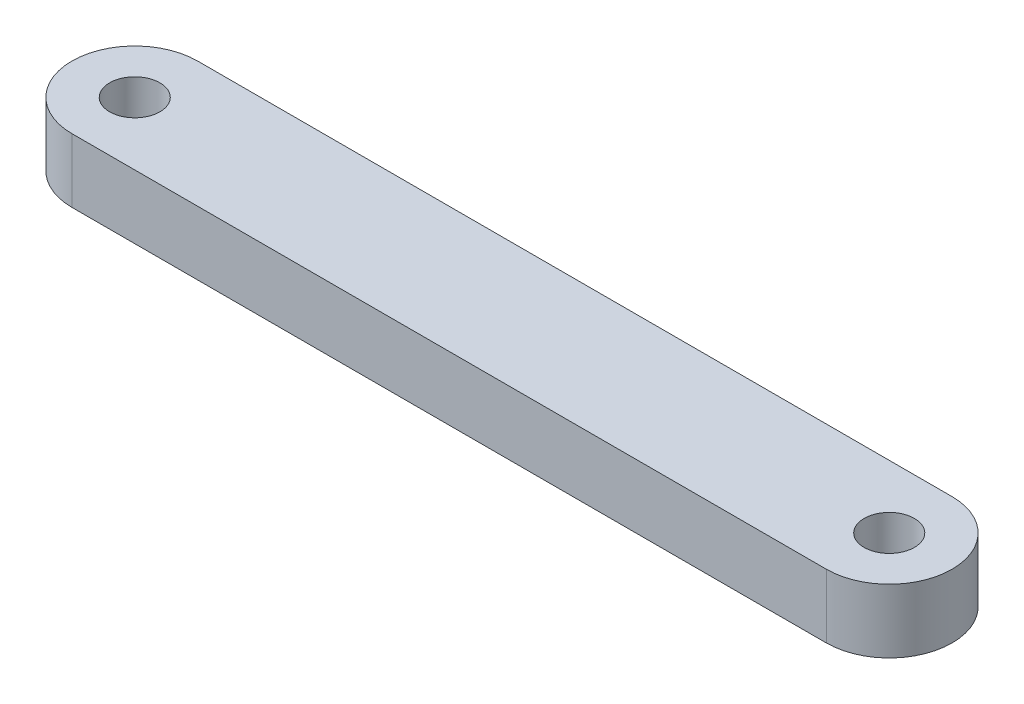
ISO-10303-21;
HEADER;
FILE_DESCRIPTION(('STEP AP214'),'2;1');
FILE_NAME('part.step','',(''),(''),'','','');
FILE_SCHEMA(('AUTOMOTIVE_DESIGN { 1 0 10303 214 1 1 1 1 }'));
ENDSEC;
DATA;
#1=APPLICATION_CONTEXT('core data for automotive mechanical design processes');
#2=APPLICATION_PROTOCOL_DEFINITION('international standard','automotive_design',2000,#1);
#3=PRODUCT_CONTEXT('',#1,'mechanical');
#4=PRODUCT('Part','Part','',(#3));
#5=PRODUCT_RELATED_PRODUCT_CATEGORY('part','',(#4));
#6=PRODUCT_DEFINITION_FORMATION('','',#4);
#7=PRODUCT_DEFINITION_CONTEXT('part definition',#1,'design');
#8=PRODUCT_DEFINITION('design','',#6,#7);
#9=PRODUCT_DEFINITION_SHAPE('','',#8);
#10=(LENGTH_UNIT() NAMED_UNIT(*) SI_UNIT(.MILLI.,.METRE.));
#11=(NAMED_UNIT(*) PLANE_ANGLE_UNIT() SI_UNIT($,.RADIAN.));
#12=(NAMED_UNIT(*) SI_UNIT($,.STERADIAN.) SOLID_ANGLE_UNIT());
#13=UNCERTAINTY_MEASURE_WITH_UNIT(LENGTH_MEASURE(1.E-05),#10,'distance_accuracy_value','');
#14=(GEOMETRIC_REPRESENTATION_CONTEXT(3) GLOBAL_UNCERTAINTY_ASSIGNED_CONTEXT((#13)) GLOBAL_UNIT_ASSIGNED_CONTEXT((#10,
#11,#12)) REPRESENTATION_CONTEXT('',''));
#15=CARTESIAN_POINT('',(0.,0.,0.));
#16=DIRECTION('',(0.,0.,1.));
#17=DIRECTION('',(1.,0.,0.));
#18=AXIS2_PLACEMENT_3D('',#15,#16,#17);
#19=CARTESIAN_POINT('',(15.,2.54,0.));
#20=DIRECTION('',(0.,-1.,0.));
#21=DIRECTION('',(0.,0.,-1.));
#22=AXIS2_PLACEMENT_3D('',#19,#20,#21);
#23=CYLINDRICAL_SURFACE('',#22,2.5);
#24=CARTESIAN_POINT('',(15.,0.,0.));
#25=DIRECTION('',(0.,1.,0.));
#26=DIRECTION('',(0.,0.,-1.));
#27=AXIS2_PLACEMENT_3D('',#24,#25,#26);
#28=CIRCLE('',#27,2.5);
#29=CARTESIAN_POINT('',(15.,0.,2.5));
#30=VERTEX_POINT('',#29);
#31=CARTESIAN_POINT('',(15.,0.,-2.5));
#32=VERTEX_POINT('',#31);
#33=EDGE_CURVE('E113',#30,#32,#28,.T.);
#34=ORIENTED_EDGE('',*,*,#33,.T.);
#35=DIRECTION('',(0.,-1.,0.));
#36=VECTOR('',#35,1.);
#37=CARTESIAN_POINT('',(15.,2.54,-2.5));
#38=LINE('',#37,#36);
#39=CARTESIAN_POINT('',(15.,2.54,-2.5));
#40=VERTEX_POINT('',#39);
#41=EDGE_CURVE('E11',#40,#32,#38,.T.);
#42=ORIENTED_EDGE('',*,*,#41,.F.);
#43=CARTESIAN_POINT('',(15.,2.54,0.));
#44=DIRECTION('',(0.,1.,0.));
#45=DIRECTION('',(0.,0.,-1.));
#46=AXIS2_PLACEMENT_3D('',#43,#44,#45);
#47=CIRCLE('',#46,2.5);
#48=CARTESIAN_POINT('',(15.,2.54,2.5));
#49=VERTEX_POINT('',#48);
#50=EDGE_CURVE('E100',#49,#40,#47,.T.);
#51=ORIENTED_EDGE('',*,*,#50,.F.);
#52=DIRECTION('',(0.,-1.,0.));
#53=VECTOR('',#52,1.);
#54=CARTESIAN_POINT('',(15.,2.54,2.5));
#55=LINE('',#54,#53);
#56=EDGE_CURVE('E109',#49,#30,#55,.T.);
#57=ORIENTED_EDGE('',*,*,#56,.T.);
#58=EDGE_LOOP('',(#34,#42,#51,#57));
#59=FACE_BOUND('',#58,.T.);
#60=ADVANCED_FACE('F47',(#59),#23,.T.);
#61=CARTESIAN_POINT('',(-15.,2.54,-2.5));
#62=DIRECTION('',(0.,0.,1.));
#63=DIRECTION('',(1.,0.,0.));
#64=AXIS2_PLACEMENT_3D('',#61,#62,#63);
#65=PLANE('',#64);
#66=DIRECTION('',(-1.,0.,0.));
#67=VECTOR('',#66,1.);
#68=CARTESIAN_POINT('',(-15.,0.,-2.5));
#69=LINE('',#68,#67);
#70=CARTESIAN_POINT('',(-15.,0.,-2.5));
#71=VERTEX_POINT('',#70);
#72=EDGE_CURVE('E104',#32,#71,#69,.T.);
#73=ORIENTED_EDGE('',*,*,#72,.T.);
#74=DIRECTION('',(0.,-1.,0.));
#75=VECTOR('',#74,1.);
#76=CARTESIAN_POINT('',(-15.,2.54,-2.5));
#77=LINE('',#76,#75);
#78=CARTESIAN_POINT('',(-15.,2.54,-2.5));
#79=VERTEX_POINT('',#78);
#80=EDGE_CURVE('E56',#79,#71,#77,.T.);
#81=ORIENTED_EDGE('',*,*,#80,.F.);
#82=DIRECTION('',(-1.,0.,0.));
#83=VECTOR('',#82,1.);
#84=CARTESIAN_POINT('',(-15.,2.54,-2.5));
#85=LINE('',#84,#83);
#86=EDGE_CURVE('E95',#40,#79,#85,.T.);
#87=ORIENTED_EDGE('',*,*,#86,.F.);
#88=ORIENTED_EDGE('',*,*,#41,.T.);
#89=EDGE_LOOP('',(#73,#81,#87,#88));
#90=FACE_BOUND('',#89,.T.);
#91=ADVANCED_FACE('F103',(#90),#65,.F.);
#92=CARTESIAN_POINT('',(-15.,2.54,0.));
#93=DIRECTION('',(0.,-1.,0.));
#94=DIRECTION('',(0.,0.,-1.));
#95=AXIS2_PLACEMENT_3D('',#92,#93,#94);
#96=CYLINDRICAL_SURFACE('',#95,2.5);
#97=CARTESIAN_POINT('',(-15.,0.,0.));
#98=DIRECTION('',(0.,1.,0.));
#99=DIRECTION('',(0.,0.,1.));
#100=AXIS2_PLACEMENT_3D('',#97,#98,#99);
#101=CIRCLE('',#100,2.5);
#102=CARTESIAN_POINT('',(-15.,0.,2.5));
#103=VERTEX_POINT('',#102);
#104=EDGE_CURVE('E82',#71,#103,#101,.T.);
#105=ORIENTED_EDGE('',*,*,#104,.T.);
#106=DIRECTION('',(0.,-1.,0.));
#107=VECTOR('',#106,1.);
#108=CARTESIAN_POINT('',(-15.,2.54,2.5));
#109=LINE('',#108,#107);
#110=CARTESIAN_POINT('',(-15.,2.54,2.5));
#111=VERTEX_POINT('',#110);
#112=EDGE_CURVE('E105',#111,#103,#109,.T.);
#113=ORIENTED_EDGE('',*,*,#112,.F.);
#114=CARTESIAN_POINT('',(-15.,2.54,0.));
#115=DIRECTION('',(0.,1.,0.));
#116=DIRECTION('',(0.,0.,1.));
#117=AXIS2_PLACEMENT_3D('',#114,#115,#116);
#118=CIRCLE('',#117,2.5);
#119=EDGE_CURVE('E98',#79,#111,#118,.T.);
#120=ORIENTED_EDGE('',*,*,#119,.F.);
#121=ORIENTED_EDGE('',*,*,#80,.T.);
#122=EDGE_LOOP('',(#105,#113,#120,#121));
#123=FACE_BOUND('',#122,.T.);
#124=ADVANCED_FACE('F107',(#123),#96,.T.);
#125=CARTESIAN_POINT('',(-15.,2.54,2.5));
#126=DIRECTION('',(0.,0.,-1.));
#127=DIRECTION('',(-1.,0.,0.));
#128=AXIS2_PLACEMENT_3D('',#125,#126,#127);
#129=PLANE('',#128);
#130=DIRECTION('',(1.,0.,0.));
#131=VECTOR('',#130,1.);
#132=CARTESIAN_POINT('',(-15.,0.,2.5));
#133=LINE('',#132,#131);
#134=EDGE_CURVE('E88',#103,#30,#133,.T.);
#135=ORIENTED_EDGE('',*,*,#134,.T.);
#136=ORIENTED_EDGE('',*,*,#56,.F.);
#137=DIRECTION('',(1.,0.,0.));
#138=VECTOR('',#137,1.);
#139=CARTESIAN_POINT('',(-15.,2.54,2.5));
#140=LINE('',#139,#138);
#141=EDGE_CURVE('E65',#111,#49,#140,.T.);
#142=ORIENTED_EDGE('',*,*,#141,.F.);
#143=ORIENTED_EDGE('',*,*,#112,.T.);
#144=EDGE_LOOP('',(#135,#136,#142,#143));
#145=FACE_BOUND('',#144,.T.);
#146=ADVANCED_FACE('F139',(#145),#129,.F.);
#147=CARTESIAN_POINT('',(15.,2.54,0.));
#148=DIRECTION('',(0.,-1.,0.));
#149=DIRECTION('',(0.,0.,-1.));
#150=AXIS2_PLACEMENT_3D('',#147,#148,#149);
#151=PLANE('',#150);
#152=CARTESIAN_POINT('',(-15.,2.54,0.));
#153=DIRECTION('',(0.,1.,0.));
#154=DIRECTION('',(0.,0.,1.));
#155=AXIS2_PLACEMENT_3D('',#152,#153,#154);
#156=CIRCLE('',#155,1.);
#157=CARTESIAN_POINT('',(-15.,2.54,1.));
#158=VERTEX_POINT('',#157);
#159=EDGE_CURVE('E122',#158,#158,#156,.T.);
#160=ORIENTED_EDGE('',*,*,#159,.F.);
#161=EDGE_LOOP('',(#160));
#162=FACE_BOUND('',#161,.T.);
#163=CARTESIAN_POINT('',(15.,2.54,0.));
#164=DIRECTION('',(0.,1.,0.));
#165=DIRECTION('',(0.,0.,-1.));
#166=AXIS2_PLACEMENT_3D('',#163,#164,#165);
#167=CIRCLE('',#166,1.);
#168=CARTESIAN_POINT('',(15.,2.54,-1.));
#169=VERTEX_POINT('',#168);
#170=EDGE_CURVE('E127',#169,#169,#167,.T.);
#171=ORIENTED_EDGE('',*,*,#170,.F.);
#172=EDGE_LOOP('',(#171));
#173=FACE_BOUND('',#172,.T.);
#174=ORIENTED_EDGE('',*,*,#50,.T.);
#175=ORIENTED_EDGE('',*,*,#86,.T.);
#176=ORIENTED_EDGE('',*,*,#119,.T.);
#177=ORIENTED_EDGE('',*,*,#141,.T.);
#178=EDGE_LOOP('',(#174,#175,#176,#177));
#179=FACE_BOUND('',#178,.T.);
#180=ADVANCED_FACE('F96',(#162,#173,#179),#151,.F.);
#181=CARTESIAN_POINT('',(15.,0.,0.));
#182=DIRECTION('',(0.,-1.,0.));
#183=DIRECTION('',(0.,0.,-1.));
#184=AXIS2_PLACEMENT_3D('',#181,#182,#183);
#185=PLANE('',#184);
#186=CARTESIAN_POINT('',(-15.,0.,0.));
#187=DIRECTION('',(0.,-1.,0.));
#188=DIRECTION('',(0.,0.,-1.));
#189=AXIS2_PLACEMENT_3D('',#186,#187,#188);
#190=CIRCLE('',#189,1.);
#191=CARTESIAN_POINT('',(-15.,0.,-1.));
#192=VERTEX_POINT('',#191);
#193=EDGE_CURVE('E50',#192,#192,#190,.T.);
#194=ORIENTED_EDGE('',*,*,#193,.F.);
#195=EDGE_LOOP('',(#194));
#196=FACE_BOUND('',#195,.T.);
#197=CARTESIAN_POINT('',(15.,0.,0.));
#198=DIRECTION('',(0.,-1.,0.));
#199=DIRECTION('',(0.,0.,-1.));
#200=AXIS2_PLACEMENT_3D('',#197,#198,#199);
#201=CIRCLE('',#200,1.);
#202=CARTESIAN_POINT('',(15.,0.,-1.));
#203=VERTEX_POINT('',#202);
#204=EDGE_CURVE('E120',#203,#203,#201,.T.);
#205=ORIENTED_EDGE('',*,*,#204,.F.);
#206=EDGE_LOOP('',(#205));
#207=FACE_BOUND('',#206,.T.);
#208=ORIENTED_EDGE('',*,*,#33,.F.);
#209=ORIENTED_EDGE('',*,*,#134,.F.);
#210=ORIENTED_EDGE('',*,*,#104,.F.);
#211=ORIENTED_EDGE('',*,*,#72,.F.);
#212=EDGE_LOOP('',(#208,#209,#210,#211));
#213=FACE_BOUND('',#212,.T.);
#214=ADVANCED_FACE('F138',(#196,#207,#213),#185,.T.);
#215=CARTESIAN_POINT('',(15.,-1.2E-05,0.));
#216=DIRECTION('',(0.,1.,0.));
#217=DIRECTION('',(0.,0.,1.));
#218=AXIS2_PLACEMENT_3D('',#215,#216,#217);
#219=CYLINDRICAL_SURFACE('',#218,1.);
#220=ORIENTED_EDGE('',*,*,#204,.T.);
#221=EDGE_LOOP('',(#220));
#222=FACE_BOUND('',#221,.T.);
#223=ORIENTED_EDGE('',*,*,#170,.T.);
#224=EDGE_LOOP('',(#223));
#225=FACE_BOUND('',#224,.T.);
#226=ADVANCED_FACE('F135',(#222,#225),#219,.F.);
#227=CARTESIAN_POINT('',(-15.,-1.2E-05,0.));
#228=DIRECTION('',(0.,1.,0.));
#229=DIRECTION('',(0.,0.,1.));
#230=AXIS2_PLACEMENT_3D('',#227,#228,#229);
#231=CYLINDRICAL_SURFACE('',#230,1.);
#232=ORIENTED_EDGE('',*,*,#193,.T.);
#233=EDGE_LOOP('',(#232));
#234=FACE_BOUND('',#233,.T.);
#235=ORIENTED_EDGE('',*,*,#159,.T.);
#236=EDGE_LOOP('',(#235));
#237=FACE_BOUND('',#236,.T.);
#238=ADVANCED_FACE('F190',(#234,#237),#231,.F.);
#239=CLOSED_SHELL('',(#60,#91,#124,#146,#180,#214,#226,#238));
#240=MANIFOLD_SOLID_BREP('B2',#239);
#241=ADVANCED_BREP_SHAPE_REPRESENTATION('',(#18,#240),#14);
#242=SHAPE_DEFINITION_REPRESENTATION(#9,#241);
ENDSEC;
END-ISO-10303-21;
